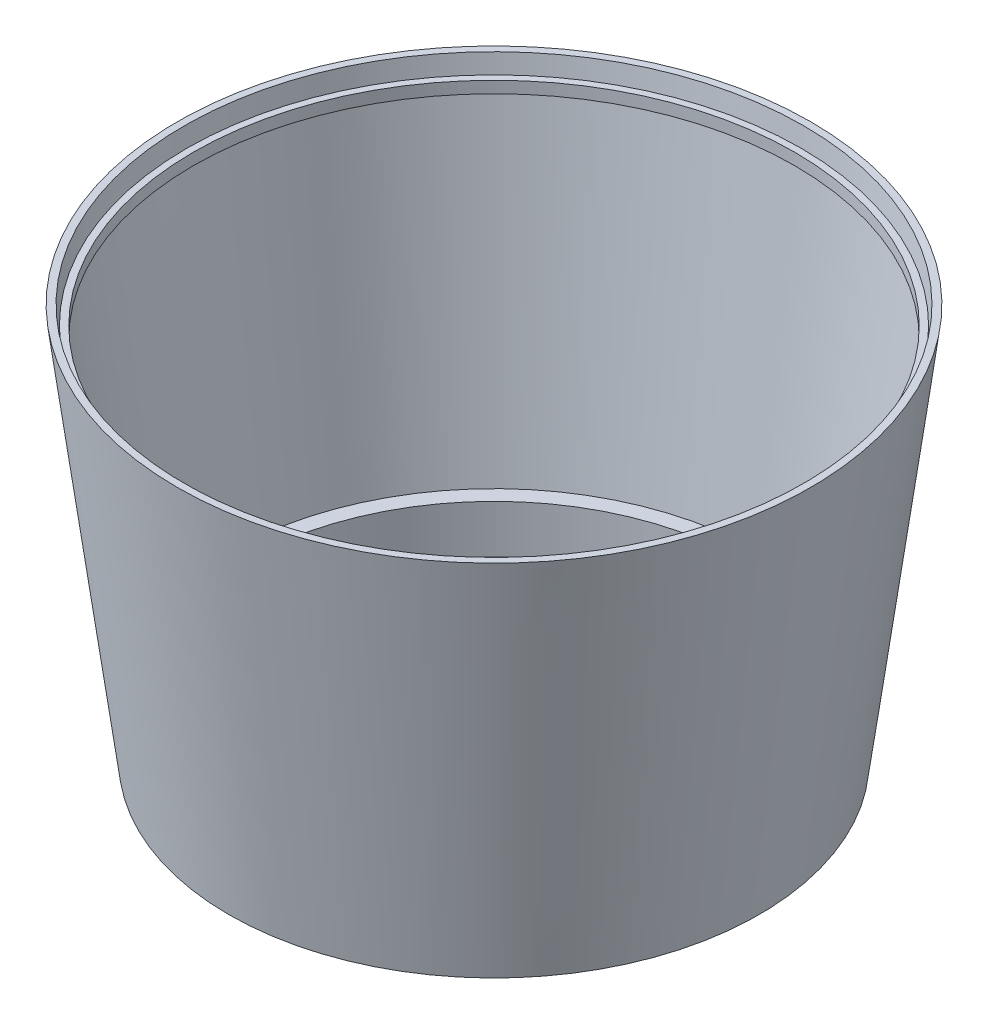
ISO-10303-21;
HEADER;
FILE_DESCRIPTION(('STEP AP214'),'2;1');
FILE_NAME('part.step','',(''),(''),'','','');
FILE_SCHEMA(('AUTOMOTIVE_DESIGN { 1 0 10303 214 1 1 1 1 }'));
ENDSEC;
DATA;
#1=APPLICATION_CONTEXT('core data for automotive mechanical design processes');
#2=APPLICATION_PROTOCOL_DEFINITION('international standard','automotive_design',2000,#1);
#3=PRODUCT_CONTEXT('',#1,'mechanical');
#4=PRODUCT('Part','Part','',(#3));
#5=PRODUCT_RELATED_PRODUCT_CATEGORY('part','',(#4));
#6=PRODUCT_DEFINITION_FORMATION('','',#4);
#7=PRODUCT_DEFINITION_CONTEXT('part definition',#1,'design');
#8=PRODUCT_DEFINITION('design','',#6,#7);
#9=PRODUCT_DEFINITION_SHAPE('','',#8);
#10=(LENGTH_UNIT() NAMED_UNIT(*) SI_UNIT(.MILLI.,.METRE.));
#11=(NAMED_UNIT(*) PLANE_ANGLE_UNIT() SI_UNIT($,.RADIAN.));
#12=(NAMED_UNIT(*) SI_UNIT($,.STERADIAN.) SOLID_ANGLE_UNIT());
#13=UNCERTAINTY_MEASURE_WITH_UNIT(LENGTH_MEASURE(1.E-05),#10,'distance_accuracy_value','');
#14=(GEOMETRIC_REPRESENTATION_CONTEXT(3) GLOBAL_UNCERTAINTY_ASSIGNED_CONTEXT((#13)) GLOBAL_UNIT_ASSIGNED_CONTEXT((#10,
#11,#12)) REPRESENTATION_CONTEXT('',''));
#15=CARTESIAN_POINT('',(0.,0.,0.));
#16=DIRECTION('',(0.,0.,1.));
#17=DIRECTION('',(1.,0.,0.));
#18=AXIS2_PLACEMENT_3D('',#15,#16,#17);
#19=CARTESIAN_POINT('',(-752.,4.52446175005497,0.));
#20=DIRECTION('',(0.,-1.,0.));
#21=DIRECTION('',(0.,0.,-1.));
#22=AXIS2_PLACEMENT_3D('',#19,#20,#21);
#23=CYLINDRICAL_SURFACE('',#22,758.378607461102);
#24=CARTESIAN_POINT('',(-752.,4.52446175005505,0.));
#25=DIRECTION('',(0.,-1.,0.));
#26=DIRECTION('',(0.,0.,-1.));
#27=AXIS2_PLACEMENT_3D('',#24,#25,#26);
#28=CIRCLE('',#27,758.378607461102);
#29=CARTESIAN_POINT('',(-752.,4.52446175005505,-758.378607461102));
#30=VERTEX_POINT('',#29);
#31=EDGE_CURVE('E67',#30,#30,#28,.T.);
#32=ORIENTED_EDGE('',*,*,#31,.T.);
#33=EDGE_LOOP('',(#32));
#34=FACE_BOUND('',#33,.T.);
#35=CARTESIAN_POINT('',(-752.,149.761263661677,0.));
#36=DIRECTION('',(0.,-1.,0.));
#37=DIRECTION('',(0.,0.,-1.));
#38=AXIS2_PLACEMENT_3D('',#35,#36,#37);
#39=CIRCLE('',#38,758.378607461102);
#40=CARTESIAN_POINT('',(-752.,149.761263661677,-758.378607461102));
#41=VERTEX_POINT('',#40);
#42=EDGE_CURVE('E10',#41,#41,#39,.T.);
#43=ORIENTED_EDGE('',*,*,#42,.F.);
#44=EDGE_LOOP('',(#43));
#45=FACE_BOUND('',#44,.T.);
#46=ADVANCED_FACE('F33',(#34,#45),#23,.F.);
#47=CARTESIAN_POINT('',(6.37860746110164,149.761263661677,0.));
#48=DIRECTION('',(0.,1.,0.));
#49=DIRECTION('',(0.,0.,1.));
#50=AXIS2_PLACEMENT_3D('',#47,#48,#49);
#51=PLANE('',#50);
#52=ORIENTED_EDGE('',*,*,#42,.T.);
#53=EDGE_LOOP('',(#52));
#54=FACE_BOUND('',#53,.T.);
#55=CARTESIAN_POINT('',(-752.,149.761263661677,0.));
#56=DIRECTION('',(0.,-1.,0.));
#57=DIRECTION('',(0.,0.,-1.));
#58=AXIS2_PLACEMENT_3D('',#55,#56,#57);
#59=CIRCLE('',#58,805.388370998963);
#60=CARTESIAN_POINT('',(-752.,149.761263661677,-805.388370998963));
#61=VERTEX_POINT('',#60);
#62=EDGE_CURVE('E39',#61,#61,#59,.T.);
#63=ORIENTED_EDGE('',*,*,#62,.F.);
#64=EDGE_LOOP('',(#63));
#65=FACE_BOUND('',#64,.T.);
#66=ADVANCED_FACE('F85',(#54,#65),#51,.T.);
#67=CARTESIAN_POINT('',(-752.,1110.55336704862,0.));
#68=DIRECTION('',(0.,1.,0.));
#69=DIRECTION('',(0.,0.,1.));
#70=AXIS2_PLACEMENT_3D('',#67,#68,#69);
#71=CONICAL_SURFACE('',#70,930.314621000099,0.129298827780159);
#72=ORIENTED_EDGE('',*,*,#62,.T.);
#73=EDGE_LOOP('',(#72));
#74=FACE_BOUND('',#73,.T.);
#75=CARTESIAN_POINT('',(-752.,1110.55336704862,0.));
#76=DIRECTION('',(0.,-1.,0.));
#77=DIRECTION('',(0.,0.,-1.));
#78=AXIS2_PLACEMENT_3D('',#75,#76,#77);
#79=CIRCLE('',#78,930.314621000099);
#80=CARTESIAN_POINT('',(-752.,1110.55336704862,-930.314621000099));
#81=VERTEX_POINT('',#80);
#82=EDGE_CURVE('E43',#81,#81,#79,.T.);
#83=ORIENTED_EDGE('',*,*,#82,.F.);
#84=EDGE_LOOP('',(#83));
#85=FACE_BOUND('',#84,.T.);
#86=ADVANCED_FACE('F89',(#74,#85),#71,.F.);
#87=CARTESIAN_POINT('',(157.741549268273,1110.55336704862,0.));
#88=DIRECTION('',(0.,-1.,0.));
#89=DIRECTION('',(0.,0.,-1.));
#90=AXIS2_PLACEMENT_3D('',#87,#88,#89);
#91=PLANE('',#90);
#92=ORIENTED_EDGE('',*,*,#82,.T.);
#93=EDGE_LOOP('',(#92));
#94=FACE_BOUND('',#93,.T.);
#95=CARTESIAN_POINT('',(-752.,1110.55336704862,0.));
#96=DIRECTION('',(0.,-1.,0.));
#97=DIRECTION('',(0.,0.,-1.));
#98=AXIS2_PLACEMENT_3D('',#95,#96,#97);
#99=CIRCLE('',#98,909.741549268273);
#100=CARTESIAN_POINT('',(-752.,1110.55336704862,-909.741549268273));
#101=VERTEX_POINT('',#100);
#102=EDGE_CURVE('E47',#101,#101,#99,.T.);
#103=ORIENTED_EDGE('',*,*,#102,.F.);
#104=EDGE_LOOP('',(#103));
#105=FACE_BOUND('',#104,.T.);
#106=ADVANCED_FACE('F93',(#94,#105),#91,.T.);
#107=CARTESIAN_POINT('',(-752.,4.52446175005497,0.));
#108=DIRECTION('',(0.,-1.,0.));
#109=DIRECTION('',(0.,0.,-1.));
#110=AXIS2_PLACEMENT_3D('',#107,#108,#109);
#111=CYLINDRICAL_SURFACE('',#110,909.741549268273);
#112=ORIENTED_EDGE('',*,*,#102,.T.);
#113=EDGE_LOOP('',(#112));
#114=FACE_BOUND('',#113,.T.);
#115=CARTESIAN_POINT('',(-752.,1145.92009298723,0.));
#116=DIRECTION('',(0.,-1.,0.));
#117=DIRECTION('',(0.,0.,-1.));
#118=AXIS2_PLACEMENT_3D('',#115,#116,#117);
#119=CIRCLE('',#118,909.741549268273);
#120=CARTESIAN_POINT('',(-752.,1145.92009298723,-909.741549268273));
#121=VERTEX_POINT('',#120);
#122=EDGE_CURVE('E52',#121,#121,#119,.T.);
#123=ORIENTED_EDGE('',*,*,#122,.F.);
#124=EDGE_LOOP('',(#123));
#125=FACE_BOUND('',#124,.T.);
#126=ADVANCED_FACE('F99',(#114,#125),#111,.F.);
#127=CARTESIAN_POINT('',(177.739311304742,1145.92009298723,0.));
#128=DIRECTION('',(0.,1.,0.));
#129=DIRECTION('',(0.,0.,1.));
#130=AXIS2_PLACEMENT_3D('',#127,#128,#129);
#131=PLANE('',#130);
#132=ORIENTED_EDGE('',*,*,#122,.T.);
#133=EDGE_LOOP('',(#132));
#134=FACE_BOUND('',#133,.T.);
#135=CARTESIAN_POINT('',(-752.,1145.92009298723,0.));
#136=DIRECTION('',(0.,-1.,0.));
#137=DIRECTION('',(0.,0.,-1.));
#138=AXIS2_PLACEMENT_3D('',#135,#136,#137);
#139=CIRCLE('',#138,929.739311304742);
#140=CARTESIAN_POINT('',(-752.,1145.92009298723,-929.739311304742));
#141=VERTEX_POINT('',#140);
#142=EDGE_CURVE('E55',#141,#141,#139,.T.);
#143=ORIENTED_EDGE('',*,*,#142,.F.);
#144=EDGE_LOOP('',(#143));
#145=FACE_BOUND('',#144,.T.);
#146=ADVANCED_FACE('F103',(#134,#145),#131,.T.);
#147=CARTESIAN_POINT('',(-752.,1201.51386574177,0.));
#148=DIRECTION('',(0.,1.,0.));
#149=DIRECTION('',(0.,0.,1.));
#150=AXIS2_PLACEMENT_3D('',#147,#148,#149);
#151=CONICAL_SURFACE('',#150,936.967848601373,0.129298827780158);
#152=ORIENTED_EDGE('',*,*,#142,.T.);
#153=EDGE_LOOP('',(#152));
#154=FACE_BOUND('',#153,.T.);
#155=CARTESIAN_POINT('',(-752.,1201.51386574177,0.));
#156=DIRECTION('',(0.,-1.,0.));
#157=DIRECTION('',(0.,0.,-1.));
#158=AXIS2_PLACEMENT_3D('',#155,#156,#157);
#159=CIRCLE('',#158,936.967848601373);
#160=CARTESIAN_POINT('',(-752.,1201.51386574177,-936.967848601373));
#161=VERTEX_POINT('',#160);
#162=EDGE_CURVE('E58',#161,#161,#159,.T.);
#163=ORIENTED_EDGE('',*,*,#162,.F.);
#164=EDGE_LOOP('',(#163));
#165=FACE_BOUND('',#164,.T.);
#166=ADVANCED_FACE('F107',(#154,#165),#151,.F.);
#167=CARTESIAN_POINT('',(206.193155345986,1201.51386574177,0.));
#168=DIRECTION('',(0.,1.,0.));
#169=DIRECTION('',(0.,0.,1.));
#170=AXIS2_PLACEMENT_3D('',#167,#168,#169);
#171=PLANE('',#170);
#172=ORIENTED_EDGE('',*,*,#162,.T.);
#173=EDGE_LOOP('',(#172));
#174=FACE_BOUND('',#173,.T.);
#175=CARTESIAN_POINT('',(-752.,1201.51386574177,0.));
#176=DIRECTION('',(0.,-1.,0.));
#177=DIRECTION('',(0.,0.,-1.));
#178=AXIS2_PLACEMENT_3D('',#175,#176,#177);
#179=CIRCLE('',#178,958.193155345986);
#180=CARTESIAN_POINT('',(-752.,1201.51386574177,-958.193155345986));
#181=VERTEX_POINT('',#180);
#182=EDGE_CURVE('E61',#181,#181,#179,.T.);
#183=ORIENTED_EDGE('',*,*,#182,.F.);
#184=EDGE_LOOP('',(#183));
#185=FACE_BOUND('',#184,.T.);
#186=ADVANCED_FACE('F81',(#174,#185),#171,.T.);
#187=CARTESIAN_POINT('',(-752.,4.52446175005505,0.));
#188=DIRECTION('',(0.,1.,0.));
#189=DIRECTION('',(0.,0.,1.));
#190=AXIS2_PLACEMENT_3D('',#187,#188,#189);
#191=CONICAL_SURFACE('',#190,802.555534049302,0.129298827780159);
#192=ORIENTED_EDGE('',*,*,#182,.T.);
#193=EDGE_LOOP('',(#192));
#194=FACE_BOUND('',#193,.T.);
#195=CARTESIAN_POINT('',(-752.,4.52446175005505,0.));
#196=DIRECTION('',(0.,-1.,0.));
#197=DIRECTION('',(0.,0.,-1.));
#198=AXIS2_PLACEMENT_3D('',#195,#196,#197);
#199=CIRCLE('',#198,802.555534049302);
#200=CARTESIAN_POINT('',(-752.,4.52446175005505,-802.555534049302));
#201=VERTEX_POINT('',#200);
#202=EDGE_CURVE('E64',#201,#201,#199,.T.);
#203=ORIENTED_EDGE('',*,*,#202,.F.);
#204=EDGE_LOOP('',(#203));
#205=FACE_BOUND('',#204,.T.);
#206=ADVANCED_FACE('F75',(#194,#205),#191,.T.);
#207=CARTESIAN_POINT('',(6.37860746110164,4.52446175005505,0.));
#208=DIRECTION('',(0.,-1.,0.));
#209=DIRECTION('',(0.,0.,-1.));
#210=AXIS2_PLACEMENT_3D('',#207,#208,#209);
#211=PLANE('',#210);
#212=ORIENTED_EDGE('',*,*,#202,.T.);
#213=EDGE_LOOP('',(#212));
#214=FACE_BOUND('',#213,.T.);
#215=ORIENTED_EDGE('',*,*,#31,.F.);
#216=EDGE_LOOP('',(#215));
#217=FACE_BOUND('',#216,.T.);
#218=ADVANCED_FACE('F73',(#214,#217),#211,.T.);
#219=CLOSED_SHELL('',(#46,#66,#86,#106,#126,#146,#166,#186,#206,#218));
#220=MANIFOLD_SOLID_BREP('B2',#219);
#221=ADVANCED_BREP_SHAPE_REPRESENTATION('',(#18,#220),#14);
#222=SHAPE_DEFINITION_REPRESENTATION(#9,#221);
ENDSEC;
END-ISO-10303-21;
